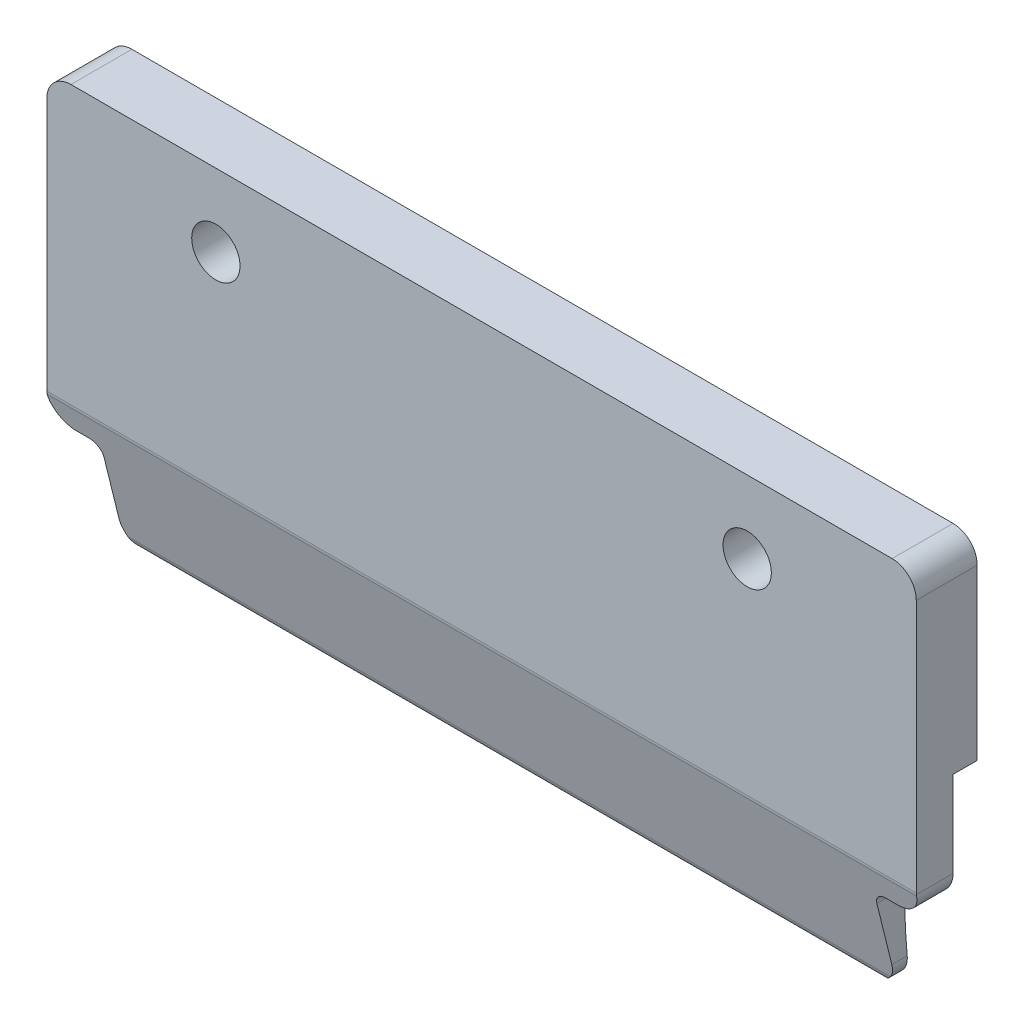
ISO-10303-21;
HEADER;
FILE_DESCRIPTION(('STEP AP214'),'2;1');
FILE_NAME('part.step','',(''),(''),'','','');
FILE_SCHEMA(('AUTOMOTIVE_DESIGN { 1 0 10303 214 1 1 1 1 }'));
ENDSEC;
DATA;
#1=APPLICATION_CONTEXT('core data for automotive mechanical design processes');
#2=APPLICATION_PROTOCOL_DEFINITION('international standard','automotive_design',2000,#1);
#3=PRODUCT_CONTEXT('',#1,'mechanical');
#4=PRODUCT('Part','Part','',(#3));
#5=PRODUCT_RELATED_PRODUCT_CATEGORY('part','',(#4));
#6=PRODUCT_DEFINITION_FORMATION('','',#4);
#7=PRODUCT_DEFINITION_CONTEXT('part definition',#1,'design');
#8=PRODUCT_DEFINITION('design','',#6,#7);
#9=PRODUCT_DEFINITION_SHAPE('','',#8);
#10=(LENGTH_UNIT() NAMED_UNIT(*) SI_UNIT(.MILLI.,.METRE.));
#11=(NAMED_UNIT(*) PLANE_ANGLE_UNIT() SI_UNIT($,.RADIAN.));
#12=(NAMED_UNIT(*) SI_UNIT($,.STERADIAN.) SOLID_ANGLE_UNIT());
#13=UNCERTAINTY_MEASURE_WITH_UNIT(LENGTH_MEASURE(1.E-05),#10,'distance_accuracy_value','');
#14=(GEOMETRIC_REPRESENTATION_CONTEXT(3) GLOBAL_UNCERTAINTY_ASSIGNED_CONTEXT((#13)) GLOBAL_UNIT_ASSIGNED_CONTEXT((#10,
#11,#12)) REPRESENTATION_CONTEXT('',''));
#15=CARTESIAN_POINT('',(0.,0.,0.));
#16=DIRECTION('',(0.,0.,1.));
#17=DIRECTION('',(1.,0.,0.));
#18=AXIS2_PLACEMENT_3D('',#15,#16,#17);
#19=CARTESIAN_POINT('',(16.9999681612747,17.3034644433608,1.5));
#20=DIRECTION('',(0.,0.,1.));
#21=DIRECTION('',(1.,0.,0.));
#22=AXIS2_PLACEMENT_3D('',#19,#20,#21);
#23=PLANE('',#22);
#24=DIRECTION('',(0.,-1.,0.));
#25=VECTOR('',#24,1.);
#26=CARTESIAN_POINT('',(-17.9999999908966,10.3045060210661,1.5));
#27=LINE('',#26,#25);
#28=CARTESIAN_POINT('',(-17.9999999908967,17.3034644433608,1.5));
#29=VERTEX_POINT('',#28);
#30=CARTESIAN_POINT('',(-17.9999999908967,6.81202558464778,1.5));
#31=VERTEX_POINT('',#30);
#32=EDGE_CURVE('E589',#29,#31,#27,.T.);
#33=ORIENTED_EDGE('',*,*,#32,.T.);
#34=DIRECTION('',(1.,0.,0.));
#35=VECTOR('',#34,1.);
#36=CARTESIAN_POINT('',(-22.0000318387253,6.81202558464777,1.5));
#37=LINE('',#36,#35);
#38=CARTESIAN_POINT('',(17.9999681612747,6.81202558464778,1.5));
#39=VERTEX_POINT('',#38);
#40=EDGE_CURVE('E451',#31,#39,#37,.T.);
#41=ORIENTED_EDGE('',*,*,#40,.T.);
#42=DIRECTION('',(0.,1.,0.));
#43=VECTOR('',#42,1.);
#44=CARTESIAN_POINT('',(17.9999681612747,9.3034644433608,1.5));
#45=LINE('',#44,#43);
#46=CARTESIAN_POINT('',(17.9999681612747,17.3034644433608,1.5));
#47=VERTEX_POINT('',#46);
#48=EDGE_CURVE('E450',#39,#47,#45,.T.);
#49=ORIENTED_EDGE('',*,*,#48,.T.);
#50=CARTESIAN_POINT('',(16.9999681612747,17.3034644433608,1.5));
#51=DIRECTION('',(0.,0.,1.));
#52=DIRECTION('',(1.,0.,0.));
#53=AXIS2_PLACEMENT_3D('',#50,#51,#52);
#54=CIRCLE('',#53,1.);
#55=CARTESIAN_POINT('',(16.9999681612747,18.3034644433608,1.5));
#56=VERTEX_POINT('',#55);
#57=EDGE_CURVE('E316',#47,#56,#54,.T.);
#58=ORIENTED_EDGE('',*,*,#57,.T.);
#59=DIRECTION('',(-1.,0.,0.));
#60=VECTOR('',#59,1.);
#61=CARTESIAN_POINT('',(16.9999681612747,18.3034644433608,1.5));
#62=LINE('',#61,#60);
#63=CARTESIAN_POINT('',(-16.9999999908967,18.3034644433608,1.5));
#64=VERTEX_POINT('',#63);
#65=EDGE_CURVE('E582',#56,#64,#62,.T.);
#66=ORIENTED_EDGE('',*,*,#65,.T.);
#67=CARTESIAN_POINT('',(-16.9999999908967,17.3034644433608,1.5));
#68=DIRECTION('',(0.,0.,1.));
#69=DIRECTION('',(-1.,0.,0.));
#70=AXIS2_PLACEMENT_3D('',#67,#68,#69);
#71=CIRCLE('',#70,1.);
#72=EDGE_CURVE('E591',#64,#29,#71,.T.);
#73=ORIENTED_EDGE('',*,*,#72,.T.);
#74=EDGE_LOOP('',(#33,#41,#49,#58,#66,#73));
#75=FACE_BOUND('',#74,.T.);
#76=CARTESIAN_POINT('',(-11.000015914811,15.2945378238837,1.5));
#77=DIRECTION('',(0.,0.,1.));
#78=DIRECTION('',(1.,0.,0.));
#79=AXIS2_PLACEMENT_3D('',#76,#77,#78);
#80=CIRCLE('',#79,1.);
#81=CARTESIAN_POINT('',(-10.000015914811,15.2945378238837,1.5));
#82=VERTEX_POINT('',#81);
#83=EDGE_CURVE('E499',#82,#82,#80,.T.);
#84=ORIENTED_EDGE('',*,*,#83,.F.);
#85=EDGE_LOOP('',(#84));
#86=FACE_BOUND('',#85,.T.);
#87=CARTESIAN_POINT('',(10.999984085189,15.2945378238837,1.5));
#88=DIRECTION('',(0.,0.,1.));
#89=DIRECTION('',(1.,0.,0.));
#90=AXIS2_PLACEMENT_3D('',#87,#88,#89);
#91=CIRCLE('',#90,1.);
#92=CARTESIAN_POINT('',(11.999984085189,15.2945378238837,1.5));
#93=VERTEX_POINT('',#92);
#94=EDGE_CURVE('E493',#93,#93,#91,.F.);
#95=ORIENTED_EDGE('',*,*,#94,.T.);
#96=EDGE_LOOP('',(#95));
#97=FACE_BOUND('',#96,.T.);
#98=ADVANCED_FACE('F70',(#75,#86,#97),#23,.T.);
#99=CARTESIAN_POINT('',(-22.0000318387253,0.,-1.02379666372447));
#100=DIRECTION('',(0.,0.,-1.));
#101=DIRECTION('',(-1.,0.,0.));
#102=AXIS2_PLACEMENT_3D('',#99,#100,#101);
#103=PLANE('',#102);
#104=DIRECTION('',(0.,1.,0.));
#105=VECTOR('',#104,1.);
#106=CARTESIAN_POINT('',(17.9999681612747,0.,-1.02379666372447));
#107=LINE('',#106,#105);
#108=CARTESIAN_POINT('',(17.9999681612747,10.3045378238837,-1.02379666372447));
#109=VERTEX_POINT('',#108);
#110=CARTESIAN_POINT('',(17.9999681612747,17.3034644433608,-1.02379666372447));
#111=VERTEX_POINT('',#110);
#112=EDGE_CURVE('E239',#109,#111,#107,.T.);
#113=ORIENTED_EDGE('',*,*,#112,.F.);
#114=DIRECTION('',(1.,0.,0.));
#115=VECTOR('',#114,1.);
#116=CARTESIAN_POINT('',(-22.0000318387253,10.3045378238837,-1.02379666372447));
#117=LINE('',#116,#115);
#118=CARTESIAN_POINT('',(-17.9999999908966,10.3045378238837,-1.02379666372447));
#119=VERTEX_POINT('',#118);
#120=EDGE_CURVE('E225',#119,#109,#117,.T.);
#121=ORIENTED_EDGE('',*,*,#120,.F.);
#122=DIRECTION('',(0.,-1.,0.));
#123=VECTOR('',#122,1.);
#124=CARTESIAN_POINT('',(-17.9999999908966,9.30453782438948,-1.02379666372447));
#125=LINE('',#124,#123);
#126=CARTESIAN_POINT('',(-17.9999999908967,17.3034644433608,-1.02379666372447));
#127=VERTEX_POINT('',#126);
#128=EDGE_CURVE('E543',#127,#119,#125,.T.);
#129=ORIENTED_EDGE('',*,*,#128,.F.);
#130=CARTESIAN_POINT('',(-16.9999999908967,17.3034644433608,-1.02379666372447));
#131=DIRECTION('',(0.,0.,-1.));
#132=DIRECTION('',(-1.,0.,0.));
#133=AXIS2_PLACEMENT_3D('',#130,#131,#132);
#134=CIRCLE('',#133,1.);
#135=CARTESIAN_POINT('',(-16.9999999908967,18.3034644433608,-1.02379666372447));
#136=VERTEX_POINT('',#135);
#137=EDGE_CURVE('E91',#136,#127,#134,.F.);
#138=ORIENTED_EDGE('',*,*,#137,.F.);
#139=DIRECTION('',(-1.,0.,0.));
#140=VECTOR('',#139,1.);
#141=CARTESIAN_POINT('',(16.9999681612747,18.3034644433608,-1.02379666372447));
#142=LINE('',#141,#140);
#143=CARTESIAN_POINT('',(16.9999681612747,18.3034644433608,-1.02379666372447));
#144=VERTEX_POINT('',#143);
#145=EDGE_CURVE('E453',#144,#136,#142,.T.);
#146=ORIENTED_EDGE('',*,*,#145,.F.);
#147=CARTESIAN_POINT('',(16.9999681612747,17.3034644433608,-1.02379666372447));
#148=DIRECTION('',(0.,0.,-1.));
#149=DIRECTION('',(-1.,0.,0.));
#150=AXIS2_PLACEMENT_3D('',#147,#148,#149);
#151=CIRCLE('',#150,1.);
#152=EDGE_CURVE('E243',#111,#144,#151,.F.);
#153=ORIENTED_EDGE('',*,*,#152,.F.);
#154=EDGE_LOOP('',(#113,#121,#129,#138,#146,#153));
#155=FACE_BOUND('',#154,.T.);
#156=CARTESIAN_POINT('',(-11.000015914811,15.2945378238837,-1.02379666372447));
#157=DIRECTION('',(0.,0.,-1.));
#158=DIRECTION('',(-1.,0.,0.));
#159=AXIS2_PLACEMENT_3D('',#156,#157,#158);
#160=CIRCLE('',#159,1.);
#161=CARTESIAN_POINT('',(-12.000015914811,15.2945378238837,-1.02379666372447));
#162=VERTEX_POINT('',#161);
#163=EDGE_CURVE('E503',#162,#162,#160,.T.);
#164=ORIENTED_EDGE('',*,*,#163,.F.);
#165=EDGE_LOOP('',(#164));
#166=FACE_BOUND('',#165,.T.);
#167=CARTESIAN_POINT('',(10.999984085189,15.2945378238837,-1.02379666372447));
#168=DIRECTION('',(0.,0.,-1.));
#169=DIRECTION('',(-1.,0.,0.));
#170=AXIS2_PLACEMENT_3D('',#167,#168,#169);
#171=CIRCLE('',#170,1.);
#172=CARTESIAN_POINT('',(9.99998408518903,15.2945378238837,-1.02379666372447));
#173=VERTEX_POINT('',#172);
#174=EDGE_CURVE('E502',#173,#173,#171,.F.);
#175=ORIENTED_EDGE('',*,*,#174,.T.);
#176=EDGE_LOOP('',(#175));
#177=FACE_BOUND('',#176,.T.);
#178=ADVANCED_FACE('F240',(#155,#166,#177),#103,.T.);
#179=CARTESIAN_POINT('',(16.9999681612747,17.3034644433608,-1.2));
#180=DIRECTION('',(0.,0.,1.));
#181=DIRECTION('',(1.,0.,0.));
#182=AXIS2_PLACEMENT_3D('',#179,#180,#181);
#183=CYLINDRICAL_SURFACE('',#182,1.);
#184=DIRECTION('',(0.,0.,1.));
#185=VECTOR('',#184,1.);
#186=CARTESIAN_POINT('',(17.9999681612747,17.3034644433608,-1.2));
#187=LINE('',#186,#185);
#188=EDGE_CURVE('E412',#111,#47,#187,.T.);
#189=ORIENTED_EDGE('',*,*,#188,.F.);
#190=ORIENTED_EDGE('',*,*,#152,.T.);
#191=DIRECTION('',(0.,0.,1.));
#192=VECTOR('',#191,1.);
#193=CARTESIAN_POINT('',(16.9999681612747,18.3034644433608,-1.2));
#194=LINE('',#193,#192);
#195=EDGE_CURVE('E448',#144,#56,#194,.T.);
#196=ORIENTED_EDGE('',*,*,#195,.T.);
#197=ORIENTED_EDGE('',*,*,#57,.F.);
#198=EDGE_LOOP('',(#189,#190,#196,#197));
#199=FACE_BOUND('',#198,.T.);
#200=ADVANCED_FACE('F72',(#199),#183,.T.);
#201=CARTESIAN_POINT('',(17.9999681612747,9.3034644433608,-1.2));
#202=DIRECTION('',(1.,0.,0.));
#203=DIRECTION('',(0.,0.,-1.));
#204=AXIS2_PLACEMENT_3D('',#201,#202,#203);
#205=PLANE('',#204);
#206=ORIENTED_EDGE('',*,*,#48,.F.);
#207=CARTESIAN_POINT('',(17.9999681612747,6.81202558464777,1.));
#208=DIRECTION('',(1.,0.,0.));
#209=DIRECTION('',(0.,0.,-1.));
#210=AXIS2_PLACEMENT_3D('',#207,#208,#209);
#211=CIRCLE('',#210,0.5);
#212=CARTESIAN_POINT('',(17.9999681612747,6.7511744579321,1.49628332671714));
#213=VERTEX_POINT('',#212);
#214=EDGE_CURVE('E99',#39,#213,#211,.T.);
#215=ORIENTED_EDGE('',*,*,#214,.T.);
#216=DIRECTION('',(0.,0.,1.));
#217=VECTOR('',#216,1.);
#218=CARTESIAN_POINT('',(17.9999681612747,6.7511744579321,-1.2));
#219=LINE('',#218,#217);
#220=CARTESIAN_POINT('',(17.9999681612747,6.7511744579321,-0.0237966637244845));
#221=VERTEX_POINT('',#220);
#222=EDGE_CURVE('E409',#221,#213,#219,.T.);
#223=ORIENTED_EDGE('',*,*,#222,.F.);
#224=DIRECTION('',(0.,1.,0.));
#225=VECTOR('',#224,1.);
#226=CARTESIAN_POINT('',(17.9999681612747,0.,-0.0237966637245102));
#227=LINE('',#226,#225);
#228=CARTESIAN_POINT('',(17.9999681612747,10.3045378238837,-0.023796663724471));
#229=VERTEX_POINT('',#228);
#230=EDGE_CURVE('E236',#221,#229,#227,.T.);
#231=ORIENTED_EDGE('',*,*,#230,.T.);
#232=DIRECTION('',(0.,0.,-1.));
#233=VECTOR('',#232,1.);
#234=CARTESIAN_POINT('',(17.9999681612747,10.3045378238837,0.));
#235=LINE('',#234,#233);
#236=EDGE_CURVE('E230',#229,#109,#235,.T.);
#237=ORIENTED_EDGE('',*,*,#236,.T.);
#238=ORIENTED_EDGE('',*,*,#112,.T.);
#239=ORIENTED_EDGE('',*,*,#188,.T.);
#240=EDGE_LOOP('',(#206,#215,#223,#231,#237,#238,#239));
#241=FACE_BOUND('',#240,.T.);
#242=ADVANCED_FACE('F249',(#241),#205,.T.);
#243=CARTESIAN_POINT('',(16.9999681612747,6.7511744579321,-1.2));
#244=DIRECTION('',(0.,0.,1.));
#245=DIRECTION('',(1.,0.,0.));
#246=AXIS2_PLACEMENT_3D('',#243,#244,#245);
#247=CYLINDRICAL_SURFACE('',#246,0.999999999999998);
#248=ORIENTED_EDGE('',*,*,#222,.T.);
#249=CARTESIAN_POINT('',(17.9999681612747,6.7511744579321,1.49628332671714));
#250=CARTESIAN_POINT('',(17.9999648772808,6.74121141273433,1.49506066706047));
#251=CARTESIAN_POINT('',(17.9998176982828,6.73130698592905,1.49354278819998));
#252=CARTESIAN_POINT('',(17.9992355502785,6.71161536910202,1.48991659207108));
#253=CARTESIAN_POINT('',(17.9988005812722,6.7018281790803,1.4878082748026));
#254=CARTESIAN_POINT('',(17.9982217172617,6.69209960745106,1.4854047383302));
#255=B_SPLINE_CURVE_WITH_KNOTS('',3,(#249,#250,#251,#252,#253,#254),.UNSPECIFIED.,.F.,.F.,(4,2,
4),(0.,0.0300634261870655,0.0601268523783933),.UNSPECIFIED.);
#256=CARTESIAN_POINT('',(17.9982217172617,6.69209960745106,1.4854047383302));
#257=VERTEX_POINT('',#256);
#258=EDGE_CURVE('E274',#213,#257,#255,.T.);
#259=ORIENTED_EDGE('',*,*,#258,.T.);
#260=CARTESIAN_POINT('',(16.9999681612747,6.7511744579321,1.5));
#261=DIRECTION('',(0.,-0.239851954393418,0.970809476660409));
#262=DIRECTION('',(0.,0.970809476660409,0.239851954393418));
#263=AXIS2_PLACEMENT_3D('',#260,#261,#262);
#264=ELLIPSE('',#263,1.03006823073051,0.999999999999998);
#265=CARTESIAN_POINT('',(16.9999681612747,5.7511744579321,1.25293612170072));
#266=VERTEX_POINT('',#265);
#267=EDGE_CURVE('E317',#257,#266,#264,.F.);
#268=ORIENTED_EDGE('',*,*,#267,.T.);
#269=DIRECTION('',(0.,0.,1.));
#270=VECTOR('',#269,1.);
#271=CARTESIAN_POINT('',(16.9999681612747,5.7511744579321,-1.2));
#272=LINE('',#271,#270);
#273=CARTESIAN_POINT('',(16.9999681612747,5.75117445793196,-0.0237158028802836));
#274=VERTEX_POINT('',#273);
#275=EDGE_CURVE('E405',#274,#266,#272,.T.);
#276=ORIENTED_EDGE('',*,*,#275,.F.);
#277=CARTESIAN_POINT('',(17.0819158255048,5.75453782388375,-0.0237966637244916));
#278=CARTESIAN_POINT('',(17.0682808921052,5.75341693831545,-0.023769688496642));
#279=CARTESIAN_POINT('',(17.0546344533862,5.75257621503533,-0.0237494624790333));
#280=CARTESIAN_POINT('',(17.0273185653095,5.75145509305145,-0.0237225088642976));
#281=CARTESIAN_POINT('',(17.0136491159518,5.75117469434768,-0.0237157812671707));
#282=CARTESIAN_POINT('',(16.9999681612747,5.7511744579321,-0.0237158028802847));
#283=B_SPLINE_CURVE_WITH_KNOTS('',3,(#277,#278,#279,#280,#281,#282),.UNSPECIFIED.,.F.,.F.,(4,2,
4),(0.,0.0410169797758226,0.0820339595516748),.UNSPECIFIED.);
#284=CARTESIAN_POINT('',(17.0819158255048,5.75453782388375,-0.0237966637244884));
#285=VERTEX_POINT('',#284);
#286=EDGE_CURVE('E369',#285,#274,#283,.T.);
#287=ORIENTED_EDGE('',*,*,#286,.F.);
#288=CARTESIAN_POINT('',(16.9999681612747,6.7511744579321,-0.0237966637244846));
#289=DIRECTION('',(0.,0.,-1.));
#290=DIRECTION('',(0.,1.,0.));
#291=AXIS2_PLACEMENT_3D('',#288,#289,#290);
#292=CIRCLE('',#291,0.999999999999998);
#293=EDGE_CURVE('E540',#285,#221,#292,.F.);
#294=ORIENTED_EDGE('',*,*,#293,.T.);
#295=EDGE_LOOP('',(#248,#259,#268,#276,#287,#294));
#296=FACE_BOUND('',#295,.T.);
#297=ADVANCED_FACE('F361',(#296),#247,.T.);
#298=CARTESIAN_POINT('',(16.9999681612747,5.7511744579321,-1.2));
#299=DIRECTION('',(0.,-1.,0.));
#300=DIRECTION('',(1.,0.,0.));
#301=AXIS2_PLACEMENT_3D('',#298,#299,#300);
#302=PLANE('',#301);
#303=ORIENTED_EDGE('',*,*,#275,.T.);
#304=DIRECTION('',(-1.,0.,0.));
#305=VECTOR('',#304,1.);
#306=CARTESIAN_POINT('',(16.9999681612747,5.7511744579321,1.25293612170072));
#307=LINE('',#306,#305);
#308=CARTESIAN_POINT('',(16.4999999908967,5.7511744579321,1.25293612170072));
#309=VERTEX_POINT('',#308);
#310=EDGE_CURVE('E395',#266,#309,#307,.T.);
#311=ORIENTED_EDGE('',*,*,#310,.T.);
#312=DIRECTION('',(0.,0.,1.));
#313=VECTOR('',#312,1.);
#314=CARTESIAN_POINT('',(16.4999999908967,5.7511744579321,-1.2));
#315=LINE('',#314,#313);
#316=CARTESIAN_POINT('',(16.4999999908967,5.7511744579321,-0.0237158028802871));
#317=VERTEX_POINT('',#316);
#318=EDGE_CURVE('E410',#317,#309,#315,.T.);
#319=ORIENTED_EDGE('',*,*,#318,.F.);
#320=DIRECTION('',(1.,0.,0.));
#321=VECTOR('',#320,1.);
#322=CARTESIAN_POINT('',(-22.0000318387253,5.75117445793196,-0.0237158028802836));
#323=LINE('',#322,#321);
#324=EDGE_CURVE('E352',#274,#317,#323,.F.);
#325=ORIENTED_EDGE('',*,*,#324,.F.);
#326=EDGE_LOOP('',(#303,#311,#319,#325));
#327=FACE_BOUND('',#326,.T.);
#328=ADVANCED_FACE('F358',(#327),#302,.T.);
#329=CARTESIAN_POINT('',(16.4999999908967,5.2511744579321,-1.2));
#330=DIRECTION('',(0.,0.,1.));
#331=DIRECTION('',(1.,0.,0.));
#332=AXIS2_PLACEMENT_3D('',#329,#330,#331);
#333=CYLINDRICAL_SURFACE('',#332,0.5);
#334=ORIENTED_EDGE('',*,*,#318,.T.);
#335=CARTESIAN_POINT('',(16.4999999908967,5.2511744579321,1.12940418255107));
#336=DIRECTION('',(0.,-0.239851954393418,0.970809476660409));
#337=DIRECTION('',(0.,0.970809476660409,0.239851954393418));
#338=AXIS2_PLACEMENT_3D('',#335,#336,#337);
#339=ELLIPSE('',#338,0.515034115365255,0.5);
#340=CARTESIAN_POINT('',(15.9999999908967,5.25117445793209,1.12940418255107));
#341=VERTEX_POINT('',#340);
#342=EDGE_CURVE('E393',#309,#341,#339,.T.);
#343=ORIENTED_EDGE('',*,*,#342,.T.);
#344=DIRECTION('',(0.,0.,1.));
#345=VECTOR('',#344,1.);
#346=CARTESIAN_POINT('',(15.9999999908967,5.25117445793209,-1.2));
#347=LINE('',#346,#345);
#348=CARTESIAN_POINT('',(15.9999999908966,5.25117445793209,-0.0165503711782068));
#349=VERTEX_POINT('',#348);
#350=EDGE_CURVE('E414',#349,#341,#347,.T.);
#351=ORIENTED_EDGE('',*,*,#350,.F.);
#352=CARTESIAN_POINT('',(16.4999999908967,5.7511744579321,-0.0237158028802871));
#353=CARTESIAN_POINT('',(16.471875384531,5.75119836962264,-0.0237176793137748));
#354=CARTESIAN_POINT('',(16.4437579985598,5.74880290983789,-0.0236589619411988));
#355=CARTESIAN_POINT('',(16.3883405645314,5.73934980214081,-0.0234342090898313));
#356=CARTESIAN_POINT('',(16.3610398840156,5.73229586487482,-0.0232682590280332));
#357=CARTESIAN_POINT('',(16.3079989092569,5.71369741912025,-0.0228427681967311));
#358=CARTESIAN_POINT('',(16.2822593636163,5.70215077564307,-0.022583182934926));
#359=CARTESIAN_POINT('',(16.2330881326508,5.67490493020884,-0.021995772738433));
#360=CARTESIAN_POINT('',(16.2096560509919,5.65920644309267,-0.0216679595529097));
#361=CARTESIAN_POINT('',(16.1657557995455,5.6240968032948,-0.020974591205691));
#362=CARTESIAN_POINT('',(16.1452881131671,5.6046850462787,-0.0206090299049555));
#363=CARTESIAN_POINT('',(16.1078977420164,5.56269669604653,-0.0198736962056207));
#364=CARTESIAN_POINT('',(16.0909757527434,5.54011948336357,-0.0195039229958123));
#365=CARTESIAN_POINT('',(16.0611570736685,5.49243815287769,-0.0187928706056048));
#366=CARTESIAN_POINT('',(16.0482618425387,5.46733312373143,-0.0184516017834865));
#367=CARTESIAN_POINT('',(16.0268761364908,5.41531866747497,-0.0178263808703688));
#368=CARTESIAN_POINT('',(16.0183830765849,5.38841030980076,-0.0175423952022588));
#369=CARTESIAN_POINT('',(16.0081522720924,5.34297700292384,-0.0171369469419324));
#370=CARTESIAN_POINT('',(16.0050970484248,5.3247380336047,-0.0169931359716457));
#371=CARTESIAN_POINT('',(16.0010211664306,5.28806011408813,-0.0167429722536724));
#372=CARTESIAN_POINT('',(15.9999976343451,5.26962148350216,-0.0166365667728736));
#373=CARTESIAN_POINT('',(15.9999999908967,5.25117445793209,-0.0165503711782082));
#374=B_SPLINE_CURVE_WITH_KNOTS('',3,(#352,#353,#354,#355,#356,#357,#358,#359,#360,#361,#362,
#363,#364,#365,#366,#367,#368,#369,#370,#371,#372,#373),.UNSPECIFIED.,.F.,.F.,(4,2,2,2,2,2,2,2,
2,2,4),(0.,0.0842615660288163,0.16845609548457,0.252690684166668,0.336910779246166,
0.421144592819399,0.505394913678191,0.589675718464712,0.673906976704528,0.729282502685622,
0.78457964588962),.UNSPECIFIED.);
#375=EDGE_CURVE('E346',#317,#349,#374,.T.);
#376=ORIENTED_EDGE('',*,*,#375,.F.);
#377=EDGE_LOOP('',(#334,#343,#351,#376));
#378=FACE_BOUND('',#377,.T.);
#379=ADVANCED_FACE('F354',(#378),#333,.F.);
#380=CARTESIAN_POINT('',(15.9999999908967,5.25117445793209,-1.2));
#381=DIRECTION('',(1.,0.,0.));
#382=DIRECTION('',(0.,0.,-1.));
#383=AXIS2_PLACEMENT_3D('',#380,#381,#382);
#384=PLANE('',#383);
#385=ORIENTED_EDGE('',*,*,#350,.T.);
#386=DIRECTION('',(0.,-0.970809476660409,-0.239851954393418));
#387=VECTOR('',#386,1.);
#388=CARTESIAN_POINT('',(15.9999999908967,4.70877141210585,0.995395982447898));
#389=LINE('',#388,#387);
#390=CARTESIAN_POINT('',(15.9999999908967,2.7511744579321,0.511744486802868));
#391=VERTEX_POINT('',#390);
#392=EDGE_CURVE('E390',#341,#391,#389,.T.);
#393=ORIENTED_EDGE('',*,*,#392,.T.);
#394=DIRECTION('',(0.,0.,1.));
#395=VECTOR('',#394,1.);
#396=CARTESIAN_POINT('',(15.9999999908967,2.7511744579321,-1.2));
#397=LINE('',#396,#395);
#398=CARTESIAN_POINT('',(15.9999999908967,2.7511744579321,-0.125575737940101));
#399=VERTEX_POINT('',#398);
#400=EDGE_CURVE('E420',#399,#391,#397,.T.);
#401=ORIENTED_EDGE('',*,*,#400,.F.);
#402=CARTESIAN_POINT('',(15.9999999908966,5.12962199757055,-25.9468654745351));
#403=DIRECTION('',(1.,0.,0.));
#404=DIRECTION('',(0.,0.,-1.));
#405=AXIS2_PLACEMENT_3D('',#402,#403,#404);
#406=CIRCLE('',#405,25.9306);
#407=EDGE_CURVE('E338',#349,#399,#406,.T.);
#408=ORIENTED_EDGE('',*,*,#407,.F.);
#409=EDGE_LOOP('',(#385,#393,#401,#408));
#410=FACE_BOUND('',#409,.T.);
#411=ADVANCED_FACE('F326',(#410),#384,.T.);
#412=CARTESIAN_POINT('',(14.9999999908967,2.7511744579321,-1.2));
#413=DIRECTION('',(0.,0.,1.));
#414=DIRECTION('',(1.,0.,0.));
#415=AXIS2_PLACEMENT_3D('',#412,#413,#414);
#416=CYLINDRICAL_SURFACE('',#415,1.);
#417=CARTESIAN_POINT('',(14.9999999908967,2.7511744579321,0.511744486802866));
#418=DIRECTION('',(0.,-0.239851954393418,0.970809476660409));
#419=DIRECTION('',(0.,0.970809476660409,0.239851954393418));
#420=AXIS2_PLACEMENT_3D('',#417,#418,#419);
#421=ELLIPSE('',#420,1.03006823073051,1.);
#422=CARTESIAN_POINT('',(15.7846602886031,2.13124848073539,0.358583170618176));
#423=VERTEX_POINT('',#422);
#424=EDGE_CURVE('E387',#391,#423,#421,.F.);
#425=ORIENTED_EDGE('',*,*,#424,.T.);
#426=CARTESIAN_POINT('',(15.7846602886031,2.13124848073539,0.358583170618176));
#427=CARTESIAN_POINT('',(15.7586555830432,2.09832622687973,0.350394378671703));
#428=CARTESIAN_POINT('',(15.7310638341286,2.06766348614767,0.339330030602437));
#429=CARTESIAN_POINT('',(15.6736864846631,2.01107148095228,0.31286960195708));
#430=CARTESIAN_POINT('',(15.6439209334688,1.98510513726069,0.29751013410824));
#431=CARTESIAN_POINT('',(15.5691138596512,1.92700870993489,0.256182457116552));
#432=CARTESIAN_POINT('',(15.5231653136097,1.89727239733152,0.22853395137489));
#433=CARTESIAN_POINT('',(15.4289846360528,1.84626710843651,0.169135682347176));
#434=CARTESIAN_POINT('',(15.3807415186905,1.82504469506811,0.137364590531493));
#435=CARTESIAN_POINT('',(15.2782942010667,1.78899877014067,0.0682596592357798));
#436=CARTESIAN_POINT('',(15.2239667900371,1.7749990085946,0.0306853634035666));
#437=CARTESIAN_POINT('',(15.1147938221055,1.75624836740398,-0.0456617289385084));
#438=CARTESIAN_POINT('',(15.0599502544993,1.75147045687478,-0.0844306832445183));
#439=CARTESIAN_POINT('',(15.0034425859497,1.75117891001586,-0.124387286853702));
#440=CARTESIAN_POINT('',(15.0017212540253,1.75117446644575,-0.125604452429665));
#441=CARTESIAN_POINT('',(14.9999999908967,1.7511744579321,-0.12682156771203));
#442=B_SPLINE_CURVE_WITH_KNOTS('',3,(#426,#427,#428,#429,#430,#431,#432,#433,#434,#435,#436,
#437,#438,#439,#440,#441),.UNSPECIFIED.,.F.,.F.,(4,2,2,2,2,2,2,4),(0.,0.127722204087582,
0.254387223970367,0.437378170524908,0.621356689264822,0.823240129206367,1.02453090881561,
1.03085547819076),.UNSPECIFIED.);
#443=CARTESIAN_POINT('',(14.9999999908966,1.7511744579321,-0.126821567712033));
#444=VERTEX_POINT('',#443);
#445=EDGE_CURVE('E307',#423,#444,#442,.T.);
#446=ORIENTED_EDGE('',*,*,#445,.T.);
#447=DIRECTION('',(0.,0.,1.));
#448=VECTOR('',#447,1.);
#449=CARTESIAN_POINT('',(14.9999999908966,1.7511744579321,-1.2));
#450=LINE('',#449,#448);
#451=CARTESIAN_POINT('',(14.9999999908966,1.7511744579321,-0.237293160280056));
#452=VERTEX_POINT('',#451);
#453=EDGE_CURVE('E423',#452,#444,#450,.T.);
#454=ORIENTED_EDGE('',*,*,#453,.F.);
#455=CARTESIAN_POINT('',(15.9999999908967,2.7511744579321,-0.125575737940101));
#456=CARTESIAN_POINT('',(15.9999997516129,2.72289910939712,-0.128179970980415));
#457=CARTESIAN_POINT('',(15.9988000147692,2.69464178760994,-0.130829965916753));
#458=CARTESIAN_POINT('',(15.9940156197121,2.63833837580376,-0.136202559755925));
#459=CARTESIAN_POINT('',(15.9904310976636,2.61029227381715,-0.138925154504984));
#460=CARTESIAN_POINT('',(15.9761365948362,2.52681825734416,-0.147165075096708));
#461=CARTESIAN_POINT('',(15.961885574281,2.4719625932454,-0.15276303268103));
#462=CARTESIAN_POINT('',(15.9243409058719,2.36544301570251,-0.163960112889909));
#463=CARTESIAN_POINT('',(15.901043299235,2.31378051107246,-0.16955923495047));
#464=CARTESIAN_POINT('',(15.8460600134313,2.21510553852121,-0.180529397411892));
#465=CARTESIAN_POINT('',(15.8143757284874,2.16809229947684,-0.185900475551305));
#466=CARTESIAN_POINT('',(15.7435062644801,2.08006219801162,-0.196172875555555));
#467=CARTESIAN_POINT('',(15.704322273831,2.0390443873601,-0.201074271662486));
#468=CARTESIAN_POINT('',(15.6195350899846,1.96417090142785,-0.210172566137797));
#469=CARTESIAN_POINT('',(15.573930774313,1.93031648112861,-0.214369341034364));
#470=CARTESIAN_POINT('',(15.4778395556464,1.87092126974996,-0.221823571551661));
#471=CARTESIAN_POINT('',(15.4273773728243,1.84534100355465,-0.225085478565456));
#472=CARTESIAN_POINT('',(15.3228283887207,1.80304154409139,-0.230521705949586));
#473=CARTESIAN_POINT('',(15.2687441357685,1.78631619316109,-0.232696782037222));
#474=CARTESIAN_POINT('',(15.1785773565084,1.76659194422358,-0.235270729268347));
#475=CARTESIAN_POINT('',(15.1430884774427,1.76081410408441,-0.236027770447802));
#476=CARTESIAN_POINT('',(15.0717383520385,1.75310592844471,-0.237039334396501));
#477=CARTESIAN_POINT('',(15.0358776923015,1.75117025247139,-0.237294554674457));
#478=CARTESIAN_POINT('',(14.9999999908966,1.7511744579321,-0.237293160280061));
#479=B_SPLINE_CURVE_WITH_KNOTS('',3,(#455,#456,#457,#458,#459,#460,#461,#462,#463,#464,#465,
#466,#467,#468,#469,#470,#471,#472,#473,#474,#475,#476,#477,#478),.UNSPECIFIED.,.F.,.F.,(4,2,2,
2,2,2,2,2,2,2,2,4),(0.,0.0851324676359856,0.17026007485209,0.34024152918921,0.510297451330853,
0.680325120672268,0.850325869450747,1.02035637668983,1.18956329304109,1.35865238870991,
1.46634905537268,1.57389592234497),.UNSPECIFIED.);
#480=EDGE_CURVE('E331',#399,#452,#479,.T.);
#481=ORIENTED_EDGE('',*,*,#480,.F.);
#482=ORIENTED_EDGE('',*,*,#400,.T.);
#483=EDGE_LOOP('',(#425,#446,#454,#481,#482));
#484=FACE_BOUND('',#483,.T.);
#485=ADVANCED_FACE('F320',(#484),#416,.T.);
#486=CARTESIAN_POINT('',(-14.9999999908967,2.7511744579321,-1.2));
#487=DIRECTION('',(0.,0.,1.));
#488=DIRECTION('',(1.,0.,0.));
#489=AXIS2_PLACEMENT_3D('',#486,#487,#488);
#490=CYLINDRICAL_SURFACE('',#489,1.);
#491=DIRECTION('',(0.,0.,1.));
#492=VECTOR('',#491,1.);
#493=CARTESIAN_POINT('',(-14.9999999908966,1.7511744579321,-1.2));
#494=LINE('',#493,#492);
#495=CARTESIAN_POINT('',(-14.9999999908967,1.7511744579321,-0.237293160280056));
#496=VERTEX_POINT('',#495);
#497=CARTESIAN_POINT('',(-14.9999999908967,1.7511744579321,-0.126821567712033));
#498=VERTEX_POINT('',#497);
#499=EDGE_CURVE('E426',#496,#498,#494,.T.);
#500=ORIENTED_EDGE('',*,*,#499,.T.);
#501=CARTESIAN_POINT('',(-15.7846602886031,2.13124848073539,0.358583170618176));
#502=CARTESIAN_POINT('',(-15.7586555830432,2.09832622687973,0.350394378671703));
#503=CARTESIAN_POINT('',(-15.7310638341286,2.06766348614767,0.339330030602437));
#504=CARTESIAN_POINT('',(-15.6736864846631,2.01107148095228,0.31286960195708));
#505=CARTESIAN_POINT('',(-15.6439209334688,1.98510513726069,0.29751013410824));
#506=CARTESIAN_POINT('',(-15.5691138596512,1.92700870993489,0.256182457116552));
#507=CARTESIAN_POINT('',(-15.5231653136097,1.89727239733152,0.22853395137489));
#508=CARTESIAN_POINT('',(-15.4289846360528,1.84626710843651,0.169135682347176));
#509=CARTESIAN_POINT('',(-15.3807415186905,1.82504469506811,0.137364590531493));
#510=CARTESIAN_POINT('',(-15.2782942010667,1.78899877014067,0.0682596592357798));
#511=CARTESIAN_POINT('',(-15.2239667900371,1.7749990085946,0.0306853634035666));
#512=CARTESIAN_POINT('',(-15.1147938221055,1.75624836740398,-0.0456617289385084));
#513=CARTESIAN_POINT('',(-15.0599502544993,1.75147045687478,-0.0844306832445183));
#514=CARTESIAN_POINT('',(-15.0034425859497,1.75117891001586,-0.124387286853702));
#515=CARTESIAN_POINT('',(-15.0017212540253,1.75117446644575,-0.125604452429665));
#516=CARTESIAN_POINT('',(-14.9999999908967,1.7511744579321,-0.12682156771203));
#517=B_SPLINE_CURVE_WITH_KNOTS('',3,(#501,#502,#503,#504,#505,#506,#507,#508,#509,#510,#511,
#512,#513,#514,#515,#516),.UNSPECIFIED.,.F.,.F.,(4,2,2,2,2,2,2,4),(0.,0.127722204087582,
0.254387223970367,0.437378170524908,0.621356689264822,0.823240129206367,1.02453090881561,
1.03085547819076),.UNSPECIFIED.);
#518=CARTESIAN_POINT('',(-15.7846602886031,2.13124848073539,0.358583170618176));
#519=VERTEX_POINT('',#518);
#520=EDGE_CURVE('E12',#498,#519,#517,.F.);
#521=ORIENTED_EDGE('',*,*,#520,.T.);
#522=CARTESIAN_POINT('',(-14.9999999908967,2.7511744579321,0.511744486802866));
#523=DIRECTION('',(0.,-0.239851954393418,0.970809476660409));
#524=DIRECTION('',(0.,0.970809476660409,0.239851954393418));
#525=AXIS2_PLACEMENT_3D('',#522,#523,#524);
#526=ELLIPSE('',#525,1.03006823073051,1.);
#527=CARTESIAN_POINT('',(-15.9999999908967,2.7511744579321,0.511744486802868));
#528=VERTEX_POINT('',#527);
#529=EDGE_CURVE('E384',#519,#528,#526,.F.);
#530=ORIENTED_EDGE('',*,*,#529,.T.);
#531=DIRECTION('',(0.,0.,1.));
#532=VECTOR('',#531,1.);
#533=CARTESIAN_POINT('',(-15.9999999908967,2.7511744579321,-1.2));
#534=LINE('',#533,#532);
#535=CARTESIAN_POINT('',(-15.9999999908967,2.7511744579321,-0.125575737940101));
#536=VERTEX_POINT('',#535);
#537=EDGE_CURVE('E429',#536,#528,#534,.T.);
#538=ORIENTED_EDGE('',*,*,#537,.F.);
#539=CARTESIAN_POINT('',(-14.9999999908966,1.7511744579321,-0.23729316028006));
#540=CARTESIAN_POINT('',(-15.0279755218537,1.75117451259731,-0.237293418045667));
#541=CARTESIAN_POINT('',(-15.0559375726446,1.75234914851384,-0.237138766892222));
#542=CARTESIAN_POINT('',(-15.1116599205576,1.75703437024343,-0.236523638943896));
#543=CARTESIAN_POINT('',(-15.1394202315626,1.7605447937491,-0.236063183398518));
#544=CARTESIAN_POINT('',(-15.2220360208037,1.7745421779764,-0.234231420253824));
#545=CARTESIAN_POINT('',(-15.2763354499483,1.78849537100947,-0.232409684228025));
#546=CARTESIAN_POINT('',(-15.3817956035086,1.82523937135603,-0.227662322394163));
#547=CARTESIAN_POINT('',(-15.4329551408678,1.84803349749352,-0.22473628204917));
#548=CARTESIAN_POINT('',(-15.5307153695212,1.90179177725756,-0.217935072231445));
#549=CARTESIAN_POINT('',(-15.5773164701636,1.93275519635564,-0.21405998809266));
#550=CARTESIAN_POINT('',(-15.6648622818307,2.00211422406037,-0.205538120590874));
#551=CARTESIAN_POINT('',(-15.7057815243501,2.04054155480835,-0.200888055926904));
#552=CARTESIAN_POINT('',(-15.780609995894,2.12365931454169,-0.191051519117248));
#553=CARTESIAN_POINT('',(-15.8145176835034,2.16835111708828,-0.185864929397475));
#554=CARTESIAN_POINT('',(-15.8746135712874,2.26309363016117,-0.175149989364954));
#555=CARTESIAN_POINT('',(-15.9007413677809,2.3131823602586,-0.169619348371503));
#556=CARTESIAN_POINT('',(-15.9441954419023,2.41702142356663,-0.158485648935339));
#557=CARTESIAN_POINT('',(-15.9615264663249,2.47076976423075,-0.152882631225021));
#558=CARTESIAN_POINT('',(-15.9827816879702,2.56253973553881,-0.143619780660668));
#559=CARTESIAN_POINT('',(-15.9892329044462,2.5999918745674,-0.139920541362453));
#560=CARTESIAN_POINT('',(-15.9978418379543,2.67534626469952,-0.132644711640458));
#561=CARTESIAN_POINT('',(-16.0000053358987,2.71324784035339,-0.129067962476211));
#562=CARTESIAN_POINT('',(-15.9999999908967,2.7511744579321,-0.125575737940099));
#563=B_SPLINE_CURVE_WITH_KNOTS('',3,(#539,#540,#541,#542,#543,#544,#545,#546,#547,#548,#549,
#550,#551,#552,#553,#554,#555,#556,#557,#558,#559,#560,#561,#562),.UNSPECIFIED.,.F.,.F.,(4,2,2,
2,2,2,2,2,2,2,2,4),(0.,0.0838747821322791,0.167743736647363,0.335158547577951,0.502636265770589,
0.67009893061016,0.838289544220954,1.00651709351317,1.17601861748151,1.34542857983896,
1.45974941947321,1.57391602100178),.UNSPECIFIED.);
#564=EDGE_CURVE('E339',#496,#536,#563,.T.);
#565=ORIENTED_EDGE('',*,*,#564,.F.);
#566=EDGE_LOOP('',(#500,#521,#530,#538,#565));
#567=FACE_BOUND('',#566,.T.);
#568=ADVANCED_FACE('F325',(#567),#490,.T.);
#569=CARTESIAN_POINT('',(-15.9999999908967,5.25117445793209,-1.2));
#570=DIRECTION('',(-1.,0.,0.));
#571=DIRECTION('',(0.,0.,1.));
#572=AXIS2_PLACEMENT_3D('',#569,#570,#571);
#573=PLANE('',#572);
#574=ORIENTED_EDGE('',*,*,#537,.T.);
#575=DIRECTION('',(0.,0.970809476660409,0.239851954393418));
#576=VECTOR('',#575,1.);
#577=CARTESIAN_POINT('',(-15.9999999908967,4.70877141210585,0.995395982447898));
#578=LINE('',#577,#576);
#579=CARTESIAN_POINT('',(-15.9999999908967,5.25117445793209,1.12940418255107));
#580=VERTEX_POINT('',#579);
#581=EDGE_CURVE('E381',#528,#580,#578,.T.);
#582=ORIENTED_EDGE('',*,*,#581,.T.);
#583=DIRECTION('',(0.,0.,1.));
#584=VECTOR('',#583,1.);
#585=CARTESIAN_POINT('',(-15.9999999908967,5.25117445793209,-1.2));
#586=LINE('',#585,#584);
#587=CARTESIAN_POINT('',(-15.9999999908967,5.25117445793209,-0.0165503711782068));
#588=VERTEX_POINT('',#587);
#589=EDGE_CURVE('E432',#588,#580,#586,.T.);
#590=ORIENTED_EDGE('',*,*,#589,.F.);
#591=CARTESIAN_POINT('',(-15.9999999908967,5.12962199757055,-25.9468654745351));
#592=DIRECTION('',(-1.,0.,0.));
#593=DIRECTION('',(0.,0.,1.));
#594=AXIS2_PLACEMENT_3D('',#591,#592,#593);
#595=CIRCLE('',#594,25.9306);
#596=EDGE_CURVE('E484',#536,#588,#595,.T.);
#597=ORIENTED_EDGE('',*,*,#596,.F.);
#598=EDGE_LOOP('',(#574,#582,#590,#597));
#599=FACE_BOUND('',#598,.T.);
#600=ADVANCED_FACE('F481',(#599),#573,.T.);
#601=CARTESIAN_POINT('',(-16.4999999908967,5.2511744579321,-1.2));
#602=DIRECTION('',(0.,0.,1.));
#603=DIRECTION('',(1.,0.,0.));
#604=AXIS2_PLACEMENT_3D('',#601,#602,#603);
#605=CYLINDRICAL_SURFACE('',#604,0.5);
#606=ORIENTED_EDGE('',*,*,#589,.T.);
#607=CARTESIAN_POINT('',(-16.4999999908967,5.2511744579321,1.12940418255107));
#608=DIRECTION('',(0.,-0.239851954393418,0.970809476660409));
#609=DIRECTION('',(0.,0.970809476660409,0.239851954393418));
#610=AXIS2_PLACEMENT_3D('',#607,#608,#609);
#611=ELLIPSE('',#610,0.515034115365255,0.5);
#612=CARTESIAN_POINT('',(-16.4999999908967,5.7511744579321,1.25293612170072));
#613=VERTEX_POINT('',#612);
#614=EDGE_CURVE('E378',#580,#613,#611,.T.);
#615=ORIENTED_EDGE('',*,*,#614,.T.);
#616=DIRECTION('',(0.,0.,1.));
#617=VECTOR('',#616,1.);
#618=CARTESIAN_POINT('',(-16.4999999908967,5.7511744579321,-1.2));
#619=LINE('',#618,#617);
#620=CARTESIAN_POINT('',(-16.4999999908967,5.7511744579321,-0.0237158028802871));
#621=VERTEX_POINT('',#620);
#622=EDGE_CURVE('E435',#621,#613,#619,.T.);
#623=ORIENTED_EDGE('',*,*,#622,.F.);
#624=CARTESIAN_POINT('',(-15.9999999908967,5.25117445793209,-0.0165503711782068));
#625=CARTESIAN_POINT('',(-15.999976098191,5.2793027384635,-0.0166804630413799));
#626=CARTESIAN_POINT('',(-16.0023721590893,5.3074235593633,-0.0168597681712694));
#627=CARTESIAN_POINT('',(-16.0118275466337,5.3628474410801,-0.0173000075543428));
#628=CARTESIAN_POINT('',(-16.018883174385,5.39015113260074,-0.0175608769730842));
#629=CARTESIAN_POINT('',(-16.0374859890604,5.4431976027104,-0.0181478460773247));
#630=CARTESIAN_POINT('',(-16.0490353101597,5.46893963289987,-0.0184739767213282));
#631=CARTESIAN_POINT('',(-16.0762875079888,5.51811523462596,-0.0191642080552818));
#632=CARTESIAN_POINT('',(-16.0919896679209,5.54154920358669,-0.0195283021860098));
#633=CARTESIAN_POINT('',(-16.1271071236014,5.58545178141471,-0.0202629388260564));
#634=CARTESIAN_POINT('',(-16.1465229128269,5.6059199955484,-0.0206334821864111));
#635=CARTESIAN_POINT('',(-16.1885200249764,5.64331052379946,-0.0213473313065091));
#636=CARTESIAN_POINT('',(-16.2111019650759,5.66023214497359,-0.0216906317353256));
#637=CARTESIAN_POINT('',(-16.258790019066,5.69004690422539,-0.0223179656074168));
#638=CARTESIAN_POINT('',(-16.2838967110997,5.70293911681927,-0.0226019854300171));
#639=CARTESIAN_POINT('',(-16.3359140664016,5.72431853513455,-0.0230835853428311));
#640=CARTESIAN_POINT('',(-16.3628236582997,5.73280833122216,-0.0232812162531977));
#641=CARTESIAN_POINT('',(-16.4082483658526,5.74303129616568,-0.0235215204330944));
#642=CARTESIAN_POINT('',(-16.4264774733681,5.74608311900675,-0.0235940919900735));
#643=CARTESIAN_POINT('',(-16.463135164898,5.75015443944078,-0.0236913435168322));
#644=CARTESIAN_POINT('',(-16.4815634298255,5.75117680931413,-0.0237160911703622));
#645=CARTESIAN_POINT('',(-16.4999999908967,5.7511744579321,-0.0237158028802856));
#646=B_SPLINE_CURVE_WITH_KNOTS('',3,(#624,#625,#626,#627,#628,#629,#630,#631,#632,#633,#634,
#635,#636,#637,#638,#639,#640,#641,#642,#643,#644,#645),.UNSPECIFIED.,.F.,.F.,(4,2,2,2,2,2,2,2,
2,2,4),(0.,0.0842734680935671,0.168480117829147,0.252726808468181,0.33695896725023,
0.42120232681738,0.505462130774784,0.589741273518916,0.673970770285553,0.729314346057007,
0.784579538180128),.UNSPECIFIED.);
#647=EDGE_CURVE('E478',#588,#621,#646,.T.);
#648=ORIENTED_EDGE('',*,*,#647,.F.);
#649=EDGE_LOOP('',(#606,#615,#623,#648));
#650=FACE_BOUND('',#649,.T.);
#651=ADVANCED_FACE('F477',(#650),#605,.F.);
#652=CARTESIAN_POINT('',(-16.9999999908966,5.7511744579321,-1.2));
#653=DIRECTION('',(0.,-1.,0.));
#654=DIRECTION('',(0.,0.,-1.));
#655=AXIS2_PLACEMENT_3D('',#652,#653,#654);
#656=PLANE('',#655);
#657=ORIENTED_EDGE('',*,*,#622,.T.);
#658=DIRECTION('',(-1.,0.,0.));
#659=VECTOR('',#658,1.);
#660=CARTESIAN_POINT('',(-16.9999999908966,5.7511744579321,1.25293612170072));
#661=LINE('',#660,#659);
#662=CARTESIAN_POINT('',(-16.9999999908966,5.7511744579321,1.25293612170072));
#663=VERTEX_POINT('',#662);
#664=EDGE_CURVE('E375',#613,#663,#661,.T.);
#665=ORIENTED_EDGE('',*,*,#664,.T.);
#666=DIRECTION('',(0.,0.,1.));
#667=VECTOR('',#666,1.);
#668=CARTESIAN_POINT('',(-16.9999999908966,5.7511744579321,-1.2));
#669=LINE('',#668,#667);
#670=CARTESIAN_POINT('',(-16.9999999908966,5.75117445793209,-0.0237158028802871));
#671=VERTEX_POINT('',#670);
#672=EDGE_CURVE('E438',#671,#663,#669,.T.);
#673=ORIENTED_EDGE('',*,*,#672,.F.);
#674=DIRECTION('',(1.,0.,0.));
#675=VECTOR('',#674,1.);
#676=CARTESIAN_POINT('',(-22.0000318387253,5.7511744579321,-0.0237158028802871));
#677=LINE('',#676,#675);
#678=EDGE_CURVE('E474',#621,#671,#677,.F.);
#679=ORIENTED_EDGE('',*,*,#678,.F.);
#680=EDGE_LOOP('',(#657,#665,#673,#679));
#681=FACE_BOUND('',#680,.T.);
#682=ADVANCED_FACE('F471',(#681),#656,.T.);
#683=CARTESIAN_POINT('',(-16.9999999908966,6.7511744579321,-1.2));
#684=DIRECTION('',(0.,0.,1.));
#685=DIRECTION('',(1.,0.,0.));
#686=AXIS2_PLACEMENT_3D('',#683,#684,#685);
#687=CYLINDRICAL_SURFACE('',#686,1.);
#688=CARTESIAN_POINT('',(-16.9999999908966,6.7511744579321,1.5));
#689=DIRECTION('',(0.,-0.239851954393418,0.970809476660409));
#690=DIRECTION('',(0.,0.970809476660409,0.239851954393418));
#691=AXIS2_PLACEMENT_3D('',#688,#689,#690);
#692=ELLIPSE('',#691,1.03006823073051,1.);
#693=CARTESIAN_POINT('',(-17.9982535468836,6.69209960745106,1.4854047383302));
#694=VERTEX_POINT('',#693);
#695=EDGE_CURVE('E84',#663,#694,#692,.F.);
#696=ORIENTED_EDGE('',*,*,#695,.T.);
#697=CARTESIAN_POINT('',(-17.9982535468836,6.69209960745106,1.4854047383302));
#698=CARTESIAN_POINT('',(-17.9988324108941,6.7018281790803,1.4878082748026));
#699=CARTESIAN_POINT('',(-17.9992673799005,6.71161536910202,1.48991659207108));
#700=CARTESIAN_POINT('',(-17.9998495279048,6.73130698592905,1.49354278819998));
#701=CARTESIAN_POINT('',(-17.9999967069028,6.74121141273434,1.49506066706048));
#702=CARTESIAN_POINT('',(-17.9999999908967,6.7511744579321,1.49628332671715));
#703=B_SPLINE_CURVE_WITH_KNOTS('',3,(#697,#698,#699,#700,#701,#702),.UNSPECIFIED.,.F.,.F.,(4,2,
4),(0.,0.0300634261913307,0.0601268523783985),.UNSPECIFIED.);
#704=CARTESIAN_POINT('',(-17.9999999908966,6.7511744579321,1.49628332671714));
#705=VERTEX_POINT('',#704);
#706=EDGE_CURVE('E265',#694,#705,#703,.T.);
#707=ORIENTED_EDGE('',*,*,#706,.T.);
#708=DIRECTION('',(0.,0.,1.));
#709=VECTOR('',#708,1.);
#710=CARTESIAN_POINT('',(-17.9999999908966,6.7511744579321,-1.2));
#711=LINE('',#710,#709);
#712=CARTESIAN_POINT('',(-17.9999999908966,6.7511744579321,-0.0237966637244846));
#713=VERTEX_POINT('',#712);
#714=EDGE_CURVE('E441',#713,#705,#711,.T.);
#715=ORIENTED_EDGE('',*,*,#714,.F.);
#716=CARTESIAN_POINT('',(-16.9999999908966,6.7511744579321,-0.0237966637244846));
#717=DIRECTION('',(0.,0.,-1.));
#718=DIRECTION('',(0.,1.,0.));
#719=AXIS2_PLACEMENT_3D('',#716,#717,#718);
#720=CIRCLE('',#719,1.);
#721=CARTESIAN_POINT('',(-17.0819476551268,5.75453782388375,-0.0237966637244884));
#722=VERTEX_POINT('',#721);
#723=EDGE_CURVE('E538',#713,#722,#720,.F.);
#724=ORIENTED_EDGE('',*,*,#723,.T.);
#725=CARTESIAN_POINT('',(-16.9999999908966,5.75117445793209,-0.0237158028802871));
#726=CARTESIAN_POINT('',(-17.0136809455737,5.75117469434768,-0.0237157812671728));
#727=CARTESIAN_POINT('',(-17.0273503949315,5.75145509305145,-0.0237225088642993));
#728=CARTESIAN_POINT('',(-17.0546662830082,5.75257621503533,-0.0237494624790343));
#729=CARTESIAN_POINT('',(-17.0683127217272,5.75341693831545,-0.0237696884966426));
#730=CARTESIAN_POINT('',(-17.0819476551268,5.75453782388375,-0.0237966637244919));
#731=B_SPLINE_CURVE_WITH_KNOTS('',3,(#725,#726,#727,#728,#729,#730),.UNSPECIFIED.,.F.,.F.,(4,2,
4),(0.,0.0410169797758766,0.08203395955172),.UNSPECIFIED.);
#732=EDGE_CURVE('E459',#671,#722,#731,.T.);
#733=ORIENTED_EDGE('',*,*,#732,.F.);
#734=ORIENTED_EDGE('',*,*,#672,.T.);
#735=EDGE_LOOP('',(#696,#707,#715,#724,#733,#734));
#736=FACE_BOUND('',#735,.T.);
#737=ADVANCED_FACE('F281',(#736),#687,.T.);
#738=CARTESIAN_POINT('',(-17.9999999908966,9.30453782438948,-1.2));
#739=DIRECTION('',(-1.,0.,0.));
#740=DIRECTION('',(0.,0.,1.));
#741=AXIS2_PLACEMENT_3D('',#738,#739,#740);
#742=PLANE('',#741);
#743=ORIENTED_EDGE('',*,*,#714,.T.);
#744=CARTESIAN_POINT('',(-17.9999999908966,6.81202558464777,1.));
#745=DIRECTION('',(-1.,0.,0.));
#746=DIRECTION('',(0.,0.,1.));
#747=AXIS2_PLACEMENT_3D('',#744,#745,#746);
#748=CIRCLE('',#747,0.5);
#749=EDGE_CURVE('E258',#705,#31,#748,.T.);
#750=ORIENTED_EDGE('',*,*,#749,.T.);
#751=ORIENTED_EDGE('',*,*,#32,.F.);
#752=DIRECTION('',(0.,0.,1.));
#753=VECTOR('',#752,1.);
#754=CARTESIAN_POINT('',(-17.9999999908967,17.3034644433608,-1.2));
#755=LINE('',#754,#753);
#756=EDGE_CURVE('E444',#127,#29,#755,.T.);
#757=ORIENTED_EDGE('',*,*,#756,.F.);
#758=ORIENTED_EDGE('',*,*,#128,.T.);
#759=DIRECTION('',(0.,0.,1.));
#760=VECTOR('',#759,1.);
#761=CARTESIAN_POINT('',(-17.9999999908966,10.3045378238837,-1.2));
#762=LINE('',#761,#760);
#763=CARTESIAN_POINT('',(-17.9999999908966,10.3045378238837,-0.023796663724471));
#764=VERTEX_POINT('',#763);
#765=EDGE_CURVE('E233',#119,#764,#762,.T.);
#766=ORIENTED_EDGE('',*,*,#765,.T.);
#767=DIRECTION('',(0.,-1.,0.));
#768=VECTOR('',#767,1.);
#769=CARTESIAN_POINT('',(-17.9999999908966,9.30453782438948,-0.0237966637244749));
#770=LINE('',#769,#768);
#771=EDGE_CURVE('E456',#764,#713,#770,.T.);
#772=ORIENTED_EDGE('',*,*,#771,.T.);
#773=EDGE_LOOP('',(#743,#750,#751,#757,#758,#766,#772));
#774=FACE_BOUND('',#773,.T.);
#775=ADVANCED_FACE('F560',(#774),#742,.T.);
#776=CARTESIAN_POINT('',(-16.9999999908967,17.3034644433608,-1.2));
#777=DIRECTION('',(0.,0.,1.));
#778=DIRECTION('',(1.,0.,0.));
#779=AXIS2_PLACEMENT_3D('',#776,#777,#778);
#780=CYLINDRICAL_SURFACE('',#779,1.);
#781=DIRECTION('',(0.,0.,1.));
#782=VECTOR('',#781,1.);
#783=CARTESIAN_POINT('',(-16.9999999908967,18.3034644433608,-1.2));
#784=LINE('',#783,#782);
#785=EDGE_CURVE('E446',#136,#64,#784,.T.);
#786=ORIENTED_EDGE('',*,*,#785,.F.);
#787=ORIENTED_EDGE('',*,*,#137,.T.);
#788=ORIENTED_EDGE('',*,*,#756,.T.);
#789=ORIENTED_EDGE('',*,*,#72,.F.);
#790=EDGE_LOOP('',(#786,#787,#788,#789));
#791=FACE_BOUND('',#790,.T.);
#792=ADVANCED_FACE('F564',(#791),#780,.T.);
#793=CARTESIAN_POINT('',(16.9999681612747,18.3034644433608,-1.2));
#794=DIRECTION('',(0.,1.,0.));
#795=DIRECTION('',(0.,0.,1.));
#796=AXIS2_PLACEMENT_3D('',#793,#794,#795);
#797=PLANE('',#796);
#798=ORIENTED_EDGE('',*,*,#195,.F.);
#799=ORIENTED_EDGE('',*,*,#145,.T.);
#800=ORIENTED_EDGE('',*,*,#785,.T.);
#801=ORIENTED_EDGE('',*,*,#65,.F.);
#802=EDGE_LOOP('',(#798,#799,#800,#801));
#803=FACE_BOUND('',#802,.T.);
#804=ADVANCED_FACE('F569',(#803),#797,.T.);
#805=CARTESIAN_POINT('',(14.9999999908966,1.7511744579321,-1.2));
#806=DIRECTION('',(0.,-1.,0.));
#807=DIRECTION('',(0.,0.,-1.));
#808=AXIS2_PLACEMENT_3D('',#805,#806,#807);
#809=PLANE('',#808);
#810=DIRECTION('',(1.,0.,0.));
#811=VECTOR('',#810,1.);
#812=CARTESIAN_POINT('',(-22.0000318387253,1.7511744579321,-0.126821567712033));
#813=LINE('',#812,#811);
#814=EDGE_CURVE('E246',#498,#444,#813,.T.);
#815=ORIENTED_EDGE('',*,*,#814,.F.);
#816=ORIENTED_EDGE('',*,*,#499,.F.);
#817=DIRECTION('',(1.,0.,0.));
#818=VECTOR('',#817,1.);
#819=CARTESIAN_POINT('',(-22.0000318387253,1.7511744579321,-0.237293160280056));
#820=LINE('',#819,#818);
#821=EDGE_CURVE('E255',#496,#452,#820,.T.);
#822=ORIENTED_EDGE('',*,*,#821,.T.);
#823=ORIENTED_EDGE('',*,*,#453,.T.);
#824=EDGE_LOOP('',(#815,#816,#822,#823));
#825=FACE_BOUND('',#824,.T.);
#826=ADVANCED_FACE('F301',(#825),#809,.T.);
#827=CARTESIAN_POINT('',(-22.0000318387253,2.2511744579321,-0.12682156771203));
#828=DIRECTION('',(1.,0.,0.));
#829=DIRECTION('',(0.,0.,-1.));
#830=AXIS2_PLACEMENT_3D('',#827,#828,#829);
#831=CYLINDRICAL_SURFACE('',#830,0.5);
#832=DIRECTION('',(1.,0.,0.));
#833=VECTOR('',#832,1.);
#834=CARTESIAN_POINT('',(-22.0000318387253,2.13124848073539,0.358583170618176));
#835=LINE('',#834,#833);
#836=EDGE_CURVE('E490',#519,#423,#835,.T.);
#837=ORIENTED_EDGE('',*,*,#836,.F.);
#838=ORIENTED_EDGE('',*,*,#520,.F.);
#839=ORIENTED_EDGE('',*,*,#814,.T.);
#840=ORIENTED_EDGE('',*,*,#445,.F.);
#841=EDGE_LOOP('',(#837,#838,#839,#840));
#842=FACE_BOUND('',#841,.T.);
#843=ADVANCED_FACE('F291',(#842),#831,.T.);
#844=CARTESIAN_POINT('',(-22.0000318387253,6.81202558464777,1.));
#845=DIRECTION('',(1.,0.,0.));
#846=DIRECTION('',(0.,0.,-1.));
#847=AXIS2_PLACEMENT_3D('',#844,#845,#846);
#848=CYLINDRICAL_SURFACE('',#847,0.5);
#849=ORIENTED_EDGE('',*,*,#214,.F.);
#850=ORIENTED_EDGE('',*,*,#40,.F.);
#851=ORIENTED_EDGE('',*,*,#749,.F.);
#852=ORIENTED_EDGE('',*,*,#706,.F.);
#853=DIRECTION('',(1.,0.,0.));
#854=VECTOR('',#853,1.);
#855=CARTESIAN_POINT('',(-22.0000318387253,6.69209960745106,1.4854047383302));
#856=LINE('',#855,#854);
#857=EDGE_CURVE('E469',#694,#257,#856,.T.);
#858=ORIENTED_EDGE('',*,*,#857,.T.);
#859=ORIENTED_EDGE('',*,*,#258,.F.);
#860=EDGE_LOOP('',(#849,#850,#851,#852,#858,#859));
#861=FACE_BOUND('',#860,.T.);
#862=ADVANCED_FACE('F285',(#861),#848,.T.);
#863=CARTESIAN_POINT('',(-22.0000318387253,0.039112220040263,-0.158308127879722));
#864=DIRECTION('',(0.,-0.239851954393418,0.970809476660409));
#865=DIRECTION('',(0.,-0.970809476660409,-0.239851954393418));
#866=AXIS2_PLACEMENT_3D('',#863,#864,#865);
#867=PLANE('',#866);
#868=ORIENTED_EDGE('',*,*,#857,.F.);
#869=ORIENTED_EDGE('',*,*,#695,.F.);
#870=ORIENTED_EDGE('',*,*,#664,.F.);
#871=ORIENTED_EDGE('',*,*,#614,.F.);
#872=ORIENTED_EDGE('',*,*,#581,.F.);
#873=ORIENTED_EDGE('',*,*,#529,.F.);
#874=ORIENTED_EDGE('',*,*,#836,.T.);
#875=ORIENTED_EDGE('',*,*,#424,.F.);
#876=ORIENTED_EDGE('',*,*,#392,.F.);
#877=ORIENTED_EDGE('',*,*,#342,.F.);
#878=ORIENTED_EDGE('',*,*,#310,.F.);
#879=ORIENTED_EDGE('',*,*,#267,.F.);
#880=EDGE_LOOP('',(#868,#869,#870,#871,#872,#873,#874,#875,#876,#877,#878,#879));
#881=FACE_BOUND('',#880,.T.);
#882=ADVANCED_FACE('F290',(#881),#867,.T.);
#883=CARTESIAN_POINT('',(-22.0000318387253,5.12962199757055,-25.9468654745351));
#884=DIRECTION('',(1.,0.,0.));
#885=DIRECTION('',(0.,0.,-1.));
#886=AXIS2_PLACEMENT_3D('',#883,#884,#885);
#887=CYLINDRICAL_SURFACE('',#886,25.9306);
#888=ORIENTED_EDGE('',*,*,#286,.T.);
#889=ORIENTED_EDGE('',*,*,#324,.T.);
#890=ORIENTED_EDGE('',*,*,#375,.T.);
#891=ORIENTED_EDGE('',*,*,#407,.T.);
#892=ORIENTED_EDGE('',*,*,#480,.T.);
#893=ORIENTED_EDGE('',*,*,#821,.F.);
#894=ORIENTED_EDGE('',*,*,#564,.T.);
#895=ORIENTED_EDGE('',*,*,#596,.T.);
#896=ORIENTED_EDGE('',*,*,#647,.T.);
#897=ORIENTED_EDGE('',*,*,#678,.T.);
#898=ORIENTED_EDGE('',*,*,#732,.T.);
#899=DIRECTION('',(1.,0.,0.));
#900=VECTOR('',#899,1.);
#901=CARTESIAN_POINT('',(-22.0000318387253,5.75453782388375,-0.0237966637244883));
#902=LINE('',#901,#900);
#903=EDGE_CURVE('E259',#722,#285,#902,.T.);
#904=ORIENTED_EDGE('',*,*,#903,.T.);
#905=EDGE_LOOP('',(#888,#889,#890,#891,#892,#893,#894,#895,#896,#897,#898,#904));
#906=FACE_BOUND('',#905,.T.);
#907=ADVANCED_FACE('F296',(#906),#887,.F.);
#908=CARTESIAN_POINT('',(-22.0000318387253,0.,-0.0237966637245102));
#909=DIRECTION('',(0.,0.,-1.));
#910=DIRECTION('',(0.,1.,0.));
#911=AXIS2_PLACEMENT_3D('',#908,#909,#910);
#912=PLANE('',#911);
#913=ORIENTED_EDGE('',*,*,#903,.F.);
#914=ORIENTED_EDGE('',*,*,#723,.F.);
#915=ORIENTED_EDGE('',*,*,#771,.F.);
#916=DIRECTION('',(1.,0.,0.));
#917=VECTOR('',#916,1.);
#918=CARTESIAN_POINT('',(-22.0000318387253,10.3045378238837,-0.023796663724471));
#919=LINE('',#918,#917);
#920=EDGE_CURVE('E235',#764,#229,#919,.T.);
#921=ORIENTED_EDGE('',*,*,#920,.T.);
#922=ORIENTED_EDGE('',*,*,#230,.F.);
#923=ORIENTED_EDGE('',*,*,#293,.F.);
#924=EDGE_LOOP('',(#913,#914,#915,#921,#922,#923));
#925=FACE_BOUND('',#924,.T.);
#926=ADVANCED_FACE('F529',(#925),#912,.T.);
#927=CARTESIAN_POINT('',(-22.0000318387253,10.3045378238837,0.));
#928=DIRECTION('',(0.,-1.,0.));
#929=DIRECTION('',(0.,0.,-1.));
#930=AXIS2_PLACEMENT_3D('',#927,#928,#929);
#931=PLANE('',#930);
#932=ORIENTED_EDGE('',*,*,#120,.T.);
#933=ORIENTED_EDGE('',*,*,#236,.F.);
#934=ORIENTED_EDGE('',*,*,#920,.F.);
#935=ORIENTED_EDGE('',*,*,#765,.F.);
#936=EDGE_LOOP('',(#932,#933,#934,#935));
#937=FACE_BOUND('',#936,.T.);
#938=ADVANCED_FACE('F227',(#937),#931,.T.);
#939=CARTESIAN_POINT('',(-11.000015914811,15.2945378238837,3.97620333627553));
#940=DIRECTION('',(0.,0.,-1.));
#941=DIRECTION('',(-1.,0.,0.));
#942=AXIS2_PLACEMENT_3D('',#939,#940,#941);
#943=CYLINDRICAL_SURFACE('',#942,1.);
#944=ORIENTED_EDGE('',*,*,#83,.T.);
#945=EDGE_LOOP('',(#944));
#946=FACE_BOUND('',#945,.T.);
#947=ORIENTED_EDGE('',*,*,#163,.T.);
#948=EDGE_LOOP('',(#947));
#949=FACE_BOUND('',#948,.T.);
#950=ADVANCED_FACE('F292',(#946,#949),#943,.F.);
#951=CARTESIAN_POINT('',(10.999984085189,15.2945378238837,3.97620333627553));
#952=DIRECTION('',(0.,0.,-1.));
#953=DIRECTION('',(-1.,0.,0.));
#954=AXIS2_PLACEMENT_3D('',#951,#952,#953);
#955=CYLINDRICAL_SURFACE('',#954,1.);
#956=ORIENTED_EDGE('',*,*,#94,.F.);
#957=EDGE_LOOP('',(#956));
#958=FACE_BOUND('',#957,.T.);
#959=ORIENTED_EDGE('',*,*,#174,.F.);
#960=EDGE_LOOP('',(#959));
#961=FACE_BOUND('',#960,.T.);
#962=ADVANCED_FACE('F510',(#958,#961),#955,.F.);
#963=CLOSED_SHELL('',(#98,#178,#200,#242,#297,#328,#379,#411,#485,#568,#600,#651,#682,#737,#775,
#792,#804,#826,#843,#862,#882,#907,#926,#938,#950,#962));
#964=MANIFOLD_SOLID_BREP('B2',#963);
#965=ADVANCED_BREP_SHAPE_REPRESENTATION('',(#18,#964),#14);
#966=SHAPE_DEFINITION_REPRESENTATION(#9,#965);
ENDSEC;
END-ISO-10303-21;
